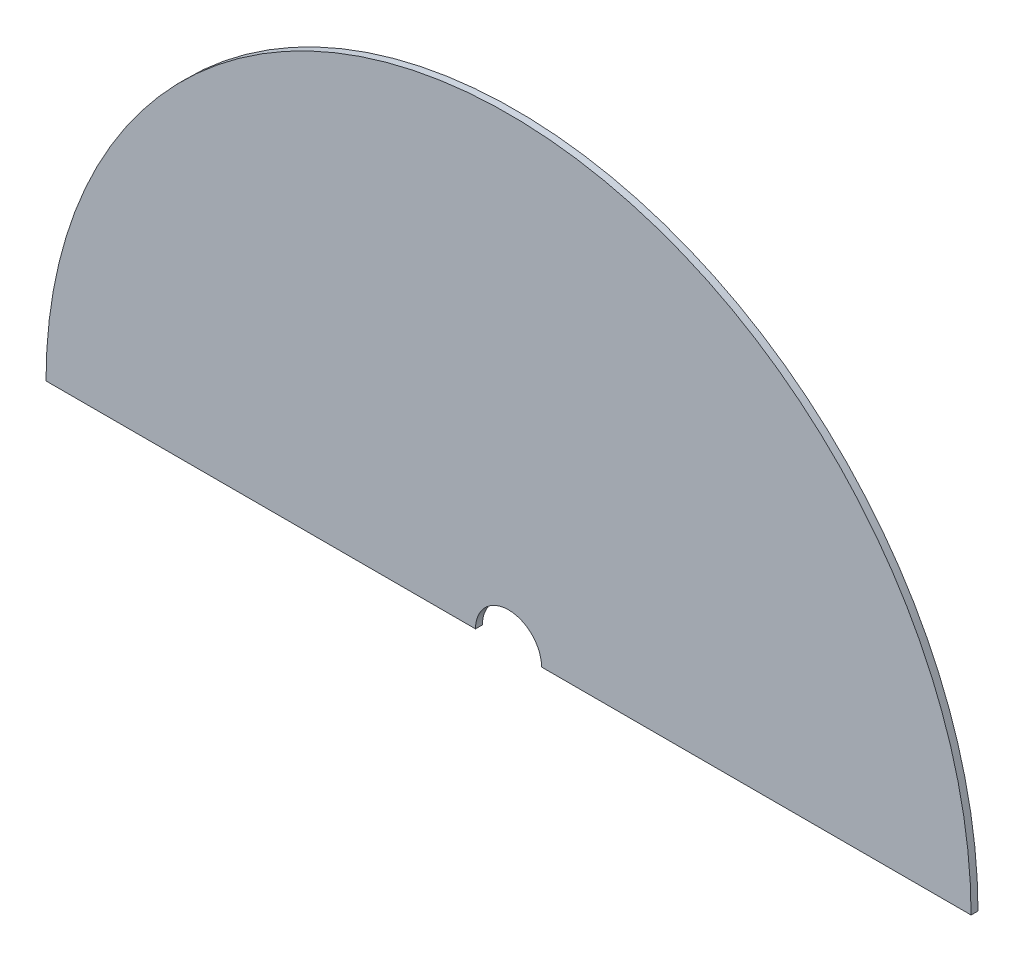
ISO-10303-21;
HEADER;
FILE_DESCRIPTION(('STEP AP214'),'2;1');
FILE_NAME('part.step','',(''),(''),'','','');
FILE_SCHEMA(('AUTOMOTIVE_DESIGN { 1 0 10303 214 1 1 1 1 }'));
ENDSEC;
DATA;
#1=APPLICATION_CONTEXT('core data for automotive mechanical design processes');
#2=APPLICATION_PROTOCOL_DEFINITION('international standard','automotive_design',2000,#1);
#3=PRODUCT_CONTEXT('',#1,'mechanical');
#4=PRODUCT('Part','Part','',(#3));
#5=PRODUCT_RELATED_PRODUCT_CATEGORY('part','',(#4));
#6=PRODUCT_DEFINITION_FORMATION('','',#4);
#7=PRODUCT_DEFINITION_CONTEXT('part definition',#1,'design');
#8=PRODUCT_DEFINITION('design','',#6,#7);
#9=PRODUCT_DEFINITION_SHAPE('','',#8);
#10=(LENGTH_UNIT() NAMED_UNIT(*) SI_UNIT(.MILLI.,.METRE.));
#11=(NAMED_UNIT(*) PLANE_ANGLE_UNIT() SI_UNIT($,.RADIAN.));
#12=(NAMED_UNIT(*) SI_UNIT($,.STERADIAN.) SOLID_ANGLE_UNIT());
#13=UNCERTAINTY_MEASURE_WITH_UNIT(LENGTH_MEASURE(1.E-05),#10,'distance_accuracy_value','');
#14=(GEOMETRIC_REPRESENTATION_CONTEXT(3) GLOBAL_UNCERTAINTY_ASSIGNED_CONTEXT((#13)) GLOBAL_UNIT_ASSIGNED_CONTEXT((#10,
#11,#12)) REPRESENTATION_CONTEXT('',''));
#15=CARTESIAN_POINT('',(0.,0.,0.));
#16=DIRECTION('',(0.,0.,1.));
#17=DIRECTION('',(1.,0.,0.));
#18=AXIS2_PLACEMENT_3D('',#15,#16,#17);
#19=CARTESIAN_POINT('',(0.,0.,-2.65684));
#20=DIRECTION('',(0.,0.,1.));
#21=DIRECTION('',(1.,0.,0.));
#22=AXIS2_PLACEMENT_3D('',#19,#20,#21);
#23=CYLINDRICAL_SURFACE('',#22,177.8);
#24=CARTESIAN_POINT('',(0.,0.,0.));
#25=DIRECTION('',(0.,0.,1.));
#26=DIRECTION('',(-1.,0.,0.));
#27=AXIS2_PLACEMENT_3D('',#24,#25,#26);
#28=CIRCLE('',#27,177.8);
#29=CARTESIAN_POINT('',(177.8,0.,0.));
#30=VERTEX_POINT('',#29);
#31=CARTESIAN_POINT('',(-177.8,0.,0.));
#32=VERTEX_POINT('',#31);
#33=EDGE_CURVE('E99',#30,#32,#28,.T.);
#34=ORIENTED_EDGE('',*,*,#33,.F.);
#35=DIRECTION('',(0.,0.,1.));
#36=VECTOR('',#35,1.);
#37=CARTESIAN_POINT('',(177.8,0.,-2.65684));
#38=LINE('',#37,#36);
#39=CARTESIAN_POINT('',(177.8,0.,-2.65684));
#40=VERTEX_POINT('',#39);
#41=EDGE_CURVE('E11',#40,#30,#38,.T.);
#42=ORIENTED_EDGE('',*,*,#41,.F.);
#43=CARTESIAN_POINT('',(0.,0.,-2.65684));
#44=DIRECTION('',(0.,0.,1.));
#45=DIRECTION('',(-1.,0.,0.));
#46=AXIS2_PLACEMENT_3D('',#43,#44,#45);
#47=CIRCLE('',#46,177.8);
#48=CARTESIAN_POINT('',(-177.8,0.,-2.65684));
#49=VERTEX_POINT('',#48);
#50=EDGE_CURVE('E58',#40,#49,#47,.T.);
#51=ORIENTED_EDGE('',*,*,#50,.T.);
#52=DIRECTION('',(0.,0.,1.));
#53=VECTOR('',#52,1.);
#54=CARTESIAN_POINT('',(-177.8,0.,-2.65684));
#55=LINE('',#54,#53);
#56=EDGE_CURVE('E43',#49,#32,#55,.T.);
#57=ORIENTED_EDGE('',*,*,#56,.T.);
#58=EDGE_LOOP('',(#34,#42,#51,#57));
#59=FACE_BOUND('',#58,.T.);
#60=ADVANCED_FACE('F39',(#59),#23,.T.);
#61=CARTESIAN_POINT('',(12.7,0.,-2.65684));
#62=DIRECTION('',(0.,-1.,0.));
#63=DIRECTION('',(1.,0.,0.));
#64=AXIS2_PLACEMENT_3D('',#61,#62,#63);
#65=PLANE('',#64);
#66=DIRECTION('',(1.,0.,0.));
#67=VECTOR('',#66,1.);
#68=CARTESIAN_POINT('',(12.7,0.,0.));
#69=LINE('',#68,#67);
#70=CARTESIAN_POINT('',(12.7,0.,0.));
#71=VERTEX_POINT('',#70);
#72=EDGE_CURVE('E106',#71,#30,#69,.T.);
#73=ORIENTED_EDGE('',*,*,#72,.F.);
#74=DIRECTION('',(0.,0.,1.));
#75=VECTOR('',#74,1.);
#76=CARTESIAN_POINT('',(12.7,0.,-2.65684));
#77=LINE('',#76,#75);
#78=CARTESIAN_POINT('',(12.7,0.,-2.65684));
#79=VERTEX_POINT('',#78);
#80=EDGE_CURVE('E49',#79,#71,#77,.T.);
#81=ORIENTED_EDGE('',*,*,#80,.F.);
#82=DIRECTION('',(1.,0.,0.));
#83=VECTOR('',#82,1.);
#84=CARTESIAN_POINT('',(12.7,0.,-2.65684));
#85=LINE('',#84,#83);
#86=EDGE_CURVE('E96',#79,#40,#85,.T.);
#87=ORIENTED_EDGE('',*,*,#86,.T.);
#88=ORIENTED_EDGE('',*,*,#41,.T.);
#89=EDGE_LOOP('',(#73,#81,#87,#88));
#90=FACE_BOUND('',#89,.T.);
#91=ADVANCED_FACE('F113',(#90),#65,.T.);
#92=CARTESIAN_POINT('',(0.,0.,-2.65684));
#93=DIRECTION('',(0.,0.,1.));
#94=DIRECTION('',(1.,0.,0.));
#95=AXIS2_PLACEMENT_3D('',#92,#93,#94);
#96=CYLINDRICAL_SURFACE('',#95,12.7);
#97=CARTESIAN_POINT('',(0.,0.,0.));
#98=DIRECTION('',(0.,0.,-1.));
#99=DIRECTION('',(-1.,0.,0.));
#100=AXIS2_PLACEMENT_3D('',#97,#98,#99);
#101=CIRCLE('',#100,12.7);
#102=CARTESIAN_POINT('',(-12.7,0.,0.));
#103=VERTEX_POINT('',#102);
#104=EDGE_CURVE('E92',#103,#71,#101,.T.);
#105=ORIENTED_EDGE('',*,*,#104,.F.);
#106=DIRECTION('',(0.,0.,1.));
#107=VECTOR('',#106,1.);
#108=CARTESIAN_POINT('',(-12.7,0.,-2.65684));
#109=LINE('',#108,#107);
#110=CARTESIAN_POINT('',(-12.7,0.,-2.65684));
#111=VERTEX_POINT('',#110);
#112=EDGE_CURVE('E87',#111,#103,#109,.T.);
#113=ORIENTED_EDGE('',*,*,#112,.F.);
#114=CARTESIAN_POINT('',(0.,0.,-2.65684));
#115=DIRECTION('',(0.,0.,-1.));
#116=DIRECTION('',(-1.,0.,0.));
#117=AXIS2_PLACEMENT_3D('',#114,#115,#116);
#118=CIRCLE('',#117,12.7);
#119=EDGE_CURVE('E90',#111,#79,#118,.T.);
#120=ORIENTED_EDGE('',*,*,#119,.T.);
#121=ORIENTED_EDGE('',*,*,#80,.T.);
#122=EDGE_LOOP('',(#105,#113,#120,#121));
#123=FACE_BOUND('',#122,.T.);
#124=ADVANCED_FACE('F89',(#123),#96,.F.);
#125=CARTESIAN_POINT('',(-177.8,0.,-2.65684));
#126=DIRECTION('',(0.,-1.,0.));
#127=DIRECTION('',(1.,0.,0.));
#128=AXIS2_PLACEMENT_3D('',#125,#126,#127);
#129=PLANE('',#128);
#130=DIRECTION('',(1.,0.,0.));
#131=VECTOR('',#130,1.);
#132=CARTESIAN_POINT('',(-177.8,0.,0.));
#133=LINE('',#132,#131);
#134=EDGE_CURVE('E103',#32,#103,#133,.T.);
#135=ORIENTED_EDGE('',*,*,#134,.F.);
#136=ORIENTED_EDGE('',*,*,#56,.F.);
#137=DIRECTION('',(1.,0.,0.));
#138=VECTOR('',#137,1.);
#139=CARTESIAN_POINT('',(-177.8,0.,-2.65684));
#140=LINE('',#139,#138);
#141=EDGE_CURVE('E95',#49,#111,#140,.T.);
#142=ORIENTED_EDGE('',*,*,#141,.T.);
#143=ORIENTED_EDGE('',*,*,#112,.T.);
#144=EDGE_LOOP('',(#135,#136,#142,#143));
#145=FACE_BOUND('',#144,.T.);
#146=ADVANCED_FACE('F41',(#145),#129,.T.);
#147=CARTESIAN_POINT('',(0.,0.,-2.65684));
#148=DIRECTION('',(0.,0.,-1.));
#149=DIRECTION('',(-1.,0.,0.));
#150=AXIS2_PLACEMENT_3D('',#147,#148,#149);
#151=PLANE('',#150);
#152=ORIENTED_EDGE('',*,*,#50,.F.);
#153=ORIENTED_EDGE('',*,*,#86,.F.);
#154=ORIENTED_EDGE('',*,*,#119,.F.);
#155=ORIENTED_EDGE('',*,*,#141,.F.);
#156=EDGE_LOOP('',(#152,#153,#154,#155));
#157=FACE_BOUND('',#156,.T.);
#158=ADVANCED_FACE('F94',(#157),#151,.T.);
#159=CARTESIAN_POINT('',(0.,0.,0.));
#160=DIRECTION('',(0.,0.,-1.));
#161=DIRECTION('',(-1.,0.,0.));
#162=AXIS2_PLACEMENT_3D('',#159,#160,#161);
#163=PLANE('',#162);
#164=ORIENTED_EDGE('',*,*,#33,.T.);
#165=ORIENTED_EDGE('',*,*,#134,.T.);
#166=ORIENTED_EDGE('',*,*,#104,.T.);
#167=ORIENTED_EDGE('',*,*,#72,.T.);
#168=EDGE_LOOP('',(#164,#165,#166,#167));
#169=FACE_BOUND('',#168,.T.);
#170=ADVANCED_FACE('F111',(#169),#163,.F.);
#171=CLOSED_SHELL('',(#60,#91,#124,#146,#158,#170));
#172=MANIFOLD_SOLID_BREP('B2',#171);
#173=ADVANCED_BREP_SHAPE_REPRESENTATION('',(#18,#172),#14);
#174=SHAPE_DEFINITION_REPRESENTATION(#9,#173);
ENDSEC;
END-ISO-10303-21;
